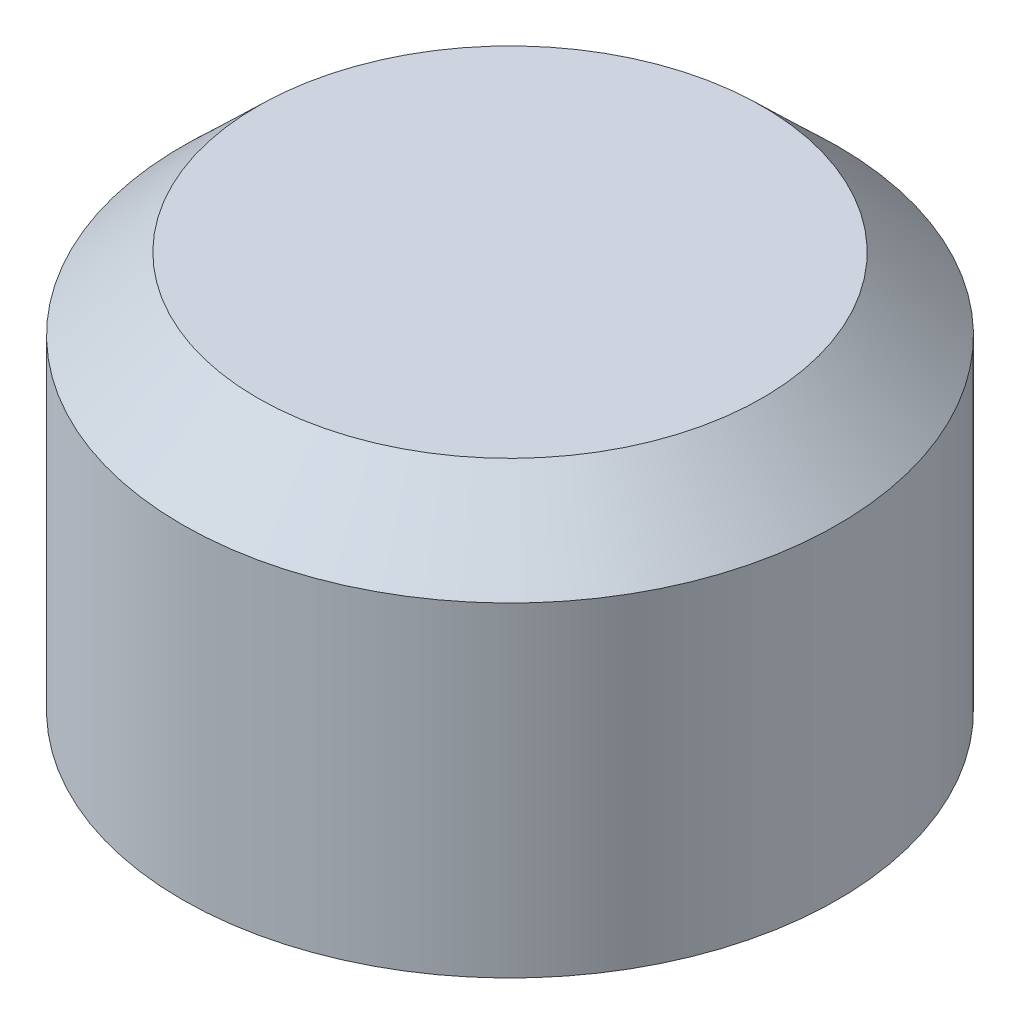
ISO-10303-21;
HEADER;
FILE_DESCRIPTION(('STEP AP214'),'2;1');
FILE_NAME('part.step','',(''),(''),'','','');
FILE_SCHEMA(('AUTOMOTIVE_DESIGN { 1 0 10303 214 1 1 1 1 }'));
ENDSEC;
DATA;
#1=APPLICATION_CONTEXT('core data for automotive mechanical design processes');
#2=APPLICATION_PROTOCOL_DEFINITION('international standard','automotive_design',2000,#1);
#3=PRODUCT_CONTEXT('',#1,'mechanical');
#4=PRODUCT('Part','Part','',(#3));
#5=PRODUCT_RELATED_PRODUCT_CATEGORY('part','',(#4));
#6=PRODUCT_DEFINITION_FORMATION('','',#4);
#7=PRODUCT_DEFINITION_CONTEXT('part definition',#1,'design');
#8=PRODUCT_DEFINITION('design','',#6,#7);
#9=PRODUCT_DEFINITION_SHAPE('','',#8);
#10=(LENGTH_UNIT() NAMED_UNIT(*) SI_UNIT(.MILLI.,.METRE.));
#11=(NAMED_UNIT(*) PLANE_ANGLE_UNIT() SI_UNIT($,.RADIAN.));
#12=(NAMED_UNIT(*) SI_UNIT($,.STERADIAN.) SOLID_ANGLE_UNIT());
#13=UNCERTAINTY_MEASURE_WITH_UNIT(LENGTH_MEASURE(1.E-05),#10,'distance_accuracy_value','');
#14=(GEOMETRIC_REPRESENTATION_CONTEXT(3) GLOBAL_UNCERTAINTY_ASSIGNED_CONTEXT((#13)) GLOBAL_UNIT_ASSIGNED_CONTEXT((#10,
#11,#12)) REPRESENTATION_CONTEXT('',''));
#15=CARTESIAN_POINT('',(0.,0.,0.));
#16=DIRECTION('',(0.,0.,1.));
#17=DIRECTION('',(1.,0.,0.));
#18=AXIS2_PLACEMENT_3D('',#15,#16,#17);
#19=CARTESIAN_POINT('',(0.,3520.44,0.));
#20=DIRECTION('',(0.,1.,0.));
#21=DIRECTION('',(0.,0.,1.));
#22=AXIS2_PLACEMENT_3D('',#19,#20,#21);
#23=CYLINDRICAL_SURFACE('',#22,2743.2);
#24=CARTESIAN_POINT('',(0.,2732.37406594724,0.));
#25=DIRECTION('',(0.,1.,0.));
#26=DIRECTION('',(0.,0.,1.));
#27=AXIS2_PLACEMENT_3D('',#24,#25,#26);
#28=CIRCLE('',#27,2743.2);
#29=CARTESIAN_POINT('',(0.,2732.37406594724,2743.2));
#30=VERTEX_POINT('',#29);
#31=EDGE_CURVE('E74',#30,#30,#28,.T.);
#32=ORIENTED_EDGE('',*,*,#31,.T.);
#33=EDGE_LOOP('',(#32));
#34=FACE_BOUND('',#33,.T.);
#35=CARTESIAN_POINT('',(0.,0.,0.));
#36=DIRECTION('',(0.,1.,0.));
#37=DIRECTION('',(0.,0.,1.));
#38=AXIS2_PLACEMENT_3D('',#35,#36,#37);
#39=CIRCLE('',#38,2743.2);
#40=CARTESIAN_POINT('',(0.,0.,2743.2));
#41=VERTEX_POINT('',#40);
#42=EDGE_CURVE('E11',#41,#41,#39,.T.);
#43=ORIENTED_EDGE('',*,*,#42,.F.);
#44=EDGE_LOOP('',(#43));
#45=FACE_BOUND('',#44,.T.);
#46=ADVANCED_FACE('F47',(#34,#45),#23,.F.);
#47=CARTESIAN_POINT('',(-2743.2,0.,0.));
#48=DIRECTION('',(0.,-1.,0.));
#49=DIRECTION('',(0.,0.,-1.));
#50=AXIS2_PLACEMENT_3D('',#47,#48,#49);
#51=PLANE('',#50);
#52=ORIENTED_EDGE('',*,*,#42,.T.);
#53=EDGE_LOOP('',(#52));
#54=FACE_BOUND('',#53,.T.);
#55=CARTESIAN_POINT('',(0.,0.,0.));
#56=DIRECTION('',(0.,1.,0.));
#57=DIRECTION('',(0.,0.,1.));
#58=AXIS2_PLACEMENT_3D('',#55,#56,#57);
#59=CIRCLE('',#58,2768.6);
#60=CARTESIAN_POINT('',(0.,0.,2768.6));
#61=VERTEX_POINT('',#60);
#62=EDGE_CURVE('E54',#61,#61,#59,.T.);
#63=ORIENTED_EDGE('',*,*,#62,.F.);
#64=EDGE_LOOP('',(#63));
#65=FACE_BOUND('',#64,.T.);
#66=ADVANCED_FACE('F93',(#54,#65),#51,.T.);
#67=CARTESIAN_POINT('',(0.,3520.44,0.));
#68=DIRECTION('',(0.,1.,0.));
#69=DIRECTION('',(0.,0.,1.));
#70=AXIS2_PLACEMENT_3D('',#67,#68,#69);
#71=CYLINDRICAL_SURFACE('',#70,2768.6);
#72=ORIENTED_EDGE('',*,*,#62,.T.);
#73=EDGE_LOOP('',(#72));
#74=FACE_BOUND('',#73,.T.);
#75=CARTESIAN_POINT('',(0.,2743.2,0.));
#76=DIRECTION('',(0.,1.,0.));
#77=DIRECTION('',(0.,0.,1.));
#78=AXIS2_PLACEMENT_3D('',#75,#76,#77);
#79=CIRCLE('',#78,2768.6);
#80=CARTESIAN_POINT('',(0.,2743.2,2768.6));
#81=VERTEX_POINT('',#80);
#82=EDGE_CURVE('E59',#81,#81,#79,.T.);
#83=ORIENTED_EDGE('',*,*,#82,.F.);
#84=EDGE_LOOP('',(#83));
#85=FACE_BOUND('',#84,.T.);
#86=ADVANCED_FACE('F97',(#74,#85),#71,.T.);
#87=CARTESIAN_POINT('',(0.,3352.8,0.));
#88=DIRECTION('',(0.,-1.,0.));
#89=DIRECTION('',(0.,0.,-1.));
#90=AXIS2_PLACEMENT_3D('',#87,#88,#89);
#91=CONICAL_SURFACE('',#90,2133.6,0.805803494083987);
#92=ORIENTED_EDGE('',*,*,#82,.T.);
#93=EDGE_LOOP('',(#92));
#94=FACE_BOUND('',#93,.T.);
#95=CARTESIAN_POINT('',(0.,3352.8,0.));
#96=DIRECTION('',(0.,1.,0.));
#97=DIRECTION('',(0.,0.,1.));
#98=AXIS2_PLACEMENT_3D('',#95,#96,#97);
#99=CIRCLE('',#98,2133.6);
#100=CARTESIAN_POINT('',(0.,3352.8,2133.6));
#101=VERTEX_POINT('',#100);
#102=EDGE_CURVE('E64',#101,#101,#99,.T.);
#103=ORIENTED_EDGE('',*,*,#102,.F.);
#104=EDGE_LOOP('',(#103));
#105=FACE_BOUND('',#104,.T.);
#106=ADVANCED_FACE('F101',(#94,#105),#91,.T.);
#107=CARTESIAN_POINT('',(0.,3352.8,0.));
#108=DIRECTION('',(0.,1.,0.));
#109=DIRECTION('',(0.,0.,1.));
#110=AXIS2_PLACEMENT_3D('',#107,#108,#109);
#111=PLANE('',#110);
#112=ORIENTED_EDGE('',*,*,#102,.T.);
#113=EDGE_LOOP('',(#112));
#114=FACE_BOUND('',#113,.T.);
#115=ADVANCED_FACE('F89',(#114),#111,.T.);
#116=CARTESIAN_POINT('',(-2123.38131869504,3327.4,0.));
#117=DIRECTION('',(0.,-1.,0.));
#118=DIRECTION('',(0.,0.,-1.));
#119=AXIS2_PLACEMENT_3D('',#116,#117,#118);
#120=PLANE('',#119);
#121=CARTESIAN_POINT('',(0.,3327.4,0.));
#122=DIRECTION('',(0.,1.,0.));
#123=DIRECTION('',(0.,0.,1.));
#124=AXIS2_PLACEMENT_3D('',#121,#122,#123);
#125=CIRCLE('',#124,2123.38131869504);
#126=CARTESIAN_POINT('',(0.,3327.4,2123.38131869504));
#127=VERTEX_POINT('',#126);
#128=EDGE_CURVE('E70',#127,#127,#125,.T.);
#129=ORIENTED_EDGE('',*,*,#128,.F.);
#130=EDGE_LOOP('',(#129));
#131=FACE_BOUND('',#130,.T.);
#132=ADVANCED_FACE('F83',(#131),#120,.T.);
#133=CARTESIAN_POINT('',(0.,2732.37406594724,0.));
#134=DIRECTION('',(0.,-1.,0.));
#135=DIRECTION('',(0.,0.,-1.));
#136=AXIS2_PLACEMENT_3D('',#133,#134,#135);
#137=CONICAL_SURFACE('',#136,2743.2,0.805803494083986);
#138=ORIENTED_EDGE('',*,*,#128,.T.);
#139=EDGE_LOOP('',(#138));
#140=FACE_BOUND('',#139,.T.);
#141=ORIENTED_EDGE('',*,*,#31,.F.);
#142=EDGE_LOOP('',(#141));
#143=FACE_BOUND('',#142,.T.);
#144=ADVANCED_FACE('F81',(#140,#143),#137,.F.);
#145=CLOSED_SHELL('',(#46,#66,#86,#106,#115,#132,#144));
#146=MANIFOLD_SOLID_BREP('B2',#145);
#147=CARTESIAN_POINT('',(-2413.,0.,0.));
#148=DIRECTION('',(0.,-1.,0.));
#149=DIRECTION('',(0.,0.,-1.));
#150=AXIS2_PLACEMENT_3D('',#147,#148,#149);
#151=PLANE('',#150);
#152=CARTESIAN_POINT('',(0.,0.,0.));
#153=DIRECTION('',(0.,1.,0.));
#154=DIRECTION('',(0.,0.,1.));
#155=AXIS2_PLACEMENT_3D('',#152,#153,#154);
#156=CIRCLE('',#155,2413.);
#157=CARTESIAN_POINT('',(0.,0.,2413.));
#158=VERTEX_POINT('',#157);
#159=EDGE_CURVE('E207',#158,#158,#156,.T.);
#160=ORIENTED_EDGE('',*,*,#159,.T.);
#161=EDGE_LOOP('',(#160));
#162=FACE_BOUND('',#161,.T.);
#163=CARTESIAN_POINT('',(0.,0.,0.));
#164=DIRECTION('',(0.,1.,0.));
#165=DIRECTION('',(0.,0.,1.));
#166=AXIS2_PLACEMENT_3D('',#163,#164,#165);
#167=CIRCLE('',#166,2438.4);
#168=CARTESIAN_POINT('',(0.,0.,2438.4));
#169=VERTEX_POINT('',#168);
#170=EDGE_CURVE('E46',#169,#169,#167,.T.);
#171=ORIENTED_EDGE('',*,*,#170,.F.);
#172=EDGE_LOOP('',(#171));
#173=FACE_BOUND('',#172,.T.);
#174=ADVANCED_FACE('F161',(#162,#173),#151,.T.);
#175=CARTESIAN_POINT('',(0.,3520.44,0.));
#176=DIRECTION('',(0.,1.,0.));
#177=DIRECTION('',(0.,0.,1.));
#178=AXIS2_PLACEMENT_3D('',#175,#176,#177);
#179=CYLINDRICAL_SURFACE('',#178,2438.4);
#180=ORIENTED_EDGE('',*,*,#170,.T.);
#181=EDGE_LOOP('',(#180));
#182=FACE_BOUND('',#181,.T.);
#183=CARTESIAN_POINT('',(0.,2753.72102448428,0.));
#184=DIRECTION('',(0.,1.,0.));
#185=DIRECTION('',(0.,0.,1.));
#186=AXIS2_PLACEMENT_3D('',#183,#184,#185);
#187=CIRCLE('',#186,2438.4);
#188=CARTESIAN_POINT('',(0.,2753.72102448428,2438.4));
#189=VERTEX_POINT('',#188);
#190=EDGE_CURVE('E167',#189,#189,#187,.T.);
#191=ORIENTED_EDGE('',*,*,#190,.F.);
#192=EDGE_LOOP('',(#191));
#193=FACE_BOUND('',#192,.T.);
#194=ADVANCED_FACE('F225',(#182,#193),#179,.T.);
#195=CARTESIAN_POINT('',(0.,3073.4,0.));
#196=DIRECTION('',(0.,-1.,0.));
#197=DIRECTION('',(0.,0.,-1.));
#198=AXIS2_PLACEMENT_3D('',#195,#196,#197);
#199=CONICAL_SURFACE('',#198,2118.72102448428,0.785398163397448);
#200=ORIENTED_EDGE('',*,*,#190,.T.);
#201=EDGE_LOOP('',(#200));
#202=FACE_BOUND('',#201,.T.);
#203=CARTESIAN_POINT('',(0.,3073.4,0.));
#204=DIRECTION('',(0.,1.,0.));
#205=DIRECTION('',(0.,0.,1.));
#206=AXIS2_PLACEMENT_3D('',#203,#204,#205);
#207=CIRCLE('',#206,2118.72102448428);
#208=CARTESIAN_POINT('',(0.,3073.4,2118.72102448428));
#209=VERTEX_POINT('',#208);
#210=EDGE_CURVE('E171',#209,#209,#207,.T.);
#211=ORIENTED_EDGE('',*,*,#210,.F.);
#212=EDGE_LOOP('',(#211));
#213=FACE_BOUND('',#212,.T.);
#214=ADVANCED_FACE('F229',(#202,#213),#199,.T.);
#215=CARTESIAN_POINT('',(-2118.72102448428,3073.4,0.));
#216=DIRECTION('',(0.,1.,0.));
#217=DIRECTION('',(0.,0.,1.));
#218=AXIS2_PLACEMENT_3D('',#215,#216,#217);
#219=PLANE('',#218);
#220=ORIENTED_EDGE('',*,*,#210,.T.);
#221=EDGE_LOOP('',(#220));
#222=FACE_BOUND('',#221,.T.);
#223=CARTESIAN_POINT('',(0.,3073.4,0.));
#224=DIRECTION('',(0.,1.,0.));
#225=DIRECTION('',(0.,0.,1.));
#226=AXIS2_PLACEMENT_3D('',#223,#224,#225);
#227=CIRCLE('',#226,1190.87720649982);
#228=CARTESIAN_POINT('',(0.,3073.4,1190.87720649982));
#229=VERTEX_POINT('',#228);
#230=EDGE_CURVE('E175',#229,#229,#227,.T.);
#231=ORIENTED_EDGE('',*,*,#230,.F.);
#232=EDGE_LOOP('',(#231));
#233=FACE_BOUND('',#232,.T.);
#234=ADVANCED_FACE('F233',(#222,#233),#219,.T.);
#235=CARTESIAN_POINT('',(0.,2796.92279350018,0.));
#236=DIRECTION('',(0.,1.,0.));
#237=DIRECTION('',(0.,0.,1.));
#238=AXIS2_PLACEMENT_3D('',#235,#236,#237);
#239=CONICAL_SURFACE('',#238,914.400000000001,0.785398163397449);
#240=ORIENTED_EDGE('',*,*,#230,.T.);
#241=EDGE_LOOP('',(#240));
#242=FACE_BOUND('',#241,.T.);
#243=CARTESIAN_POINT('',(0.,2796.92279350018,0.));
#244=DIRECTION('',(0.,1.,0.));
#245=DIRECTION('',(0.,0.,1.));
#246=AXIS2_PLACEMENT_3D('',#243,#244,#245);
#247=CIRCLE('',#246,914.400000000001);
#248=CARTESIAN_POINT('',(0.,2796.92279350018,914.400000000001));
#249=VERTEX_POINT('',#248);
#250=EDGE_CURVE('E180',#249,#249,#247,.T.);
#251=ORIENTED_EDGE('',*,*,#250,.F.);
#252=EDGE_LOOP('',(#251));
#253=FACE_BOUND('',#252,.T.);
#254=ADVANCED_FACE('F239',(#242,#253),#239,.F.);
#255=CARTESIAN_POINT('',(0.,3520.44,0.));
#256=DIRECTION('',(0.,1.,0.));
#257=DIRECTION('',(0.,0.,1.));
#258=AXIS2_PLACEMENT_3D('',#255,#256,#257);
#259=CYLINDRICAL_SURFACE('',#258,914.400000000001);
#260=ORIENTED_EDGE('',*,*,#250,.T.);
#261=EDGE_LOOP('',(#260));
#262=FACE_BOUND('',#261,.T.);
#263=CARTESIAN_POINT('',(0.,2074.,0.));
#264=DIRECTION('',(0.,1.,0.));
#265=DIRECTION('',(0.,0.,1.));
#266=AXIS2_PLACEMENT_3D('',#263,#264,#265);
#267=CIRCLE('',#266,914.4);
#268=CARTESIAN_POINT('',(0.,2074.,914.4));
#269=VERTEX_POINT('',#268);
#270=EDGE_CURVE('E183',#269,#269,#267,.T.);
#271=ORIENTED_EDGE('',*,*,#270,.F.);
#272=EDGE_LOOP('',(#271));
#273=FACE_BOUND('',#272,.T.);
#274=ADVANCED_FACE('F243',(#262,#273),#259,.F.);
#275=CARTESIAN_POINT('',(0.,1524.30107327311,0.));
#276=DIRECTION('',(0.,1.,0.));
#277=DIRECTION('',(0.,0.,1.));
#278=AXIS2_PLACEMENT_3D('',#275,#276,#277);
#279=CONICAL_SURFACE('',#278,597.03117668098,0.523598775598301);
#280=ORIENTED_EDGE('',*,*,#270,.T.);
#281=EDGE_LOOP('',(#280));
#282=FACE_BOUND('',#281,.T.);
#283=CARTESIAN_POINT('',(0.,1524.30107327311,0.));
#284=DIRECTION('',(0.,1.,0.));
#285=DIRECTION('',(0.,0.,1.));
#286=AXIS2_PLACEMENT_3D('',#283,#284,#285);
#287=CIRCLE('',#286,597.03117668098);
#288=CARTESIAN_POINT('',(0.,1524.30107327311,597.03117668098));
#289=VERTEX_POINT('',#288);
#290=EDGE_CURVE('E186',#289,#289,#287,.T.);
#291=ORIENTED_EDGE('',*,*,#290,.F.);
#292=EDGE_LOOP('',(#291));
#293=FACE_BOUND('',#292,.T.);
#294=ADVANCED_FACE('F247',(#282,#293),#279,.F.);
#295=CARTESIAN_POINT('',(-597.03117668098,1524.30107327311,0.));
#296=DIRECTION('',(0.,-1.,0.));
#297=DIRECTION('',(0.,0.,-1.));
#298=AXIS2_PLACEMENT_3D('',#295,#296,#297);
#299=PLANE('',#298);
#300=ORIENTED_EDGE('',*,*,#290,.T.);
#301=EDGE_LOOP('',(#300));
#302=FACE_BOUND('',#301,.T.);
#303=CARTESIAN_POINT('',(0.,1524.30107327311,0.));
#304=DIRECTION('',(0.,1.,0.));
#305=DIRECTION('',(0.,0.,1.));
#306=AXIS2_PLACEMENT_3D('',#303,#304,#305);
#307=CIRCLE('',#306,622.43117668098);
#308=CARTESIAN_POINT('',(0.,1524.30107327311,622.43117668098));
#309=VERTEX_POINT('',#308);
#310=EDGE_CURVE('E189',#309,#309,#307,.T.);
#311=ORIENTED_EDGE('',*,*,#310,.F.);
#312=EDGE_LOOP('',(#311));
#313=FACE_BOUND('',#312,.T.);
#314=ADVANCED_FACE('F251',(#302,#313),#299,.T.);
#315=CARTESIAN_POINT('',(0.,2074.,0.));
#316=DIRECTION('',(0.,1.,0.));
#317=DIRECTION('',(0.,0.,1.));
#318=AXIS2_PLACEMENT_3D('',#315,#316,#317);
#319=CONICAL_SURFACE('',#318,939.800000000001,0.523598775598303);
#320=ORIENTED_EDGE('',*,*,#310,.T.);
#321=EDGE_LOOP('',(#320));
#322=FACE_BOUND('',#321,.T.);
#323=CARTESIAN_POINT('',(0.,2074.,0.));
#324=DIRECTION('',(0.,1.,0.));
#325=DIRECTION('',(0.,0.,1.));
#326=AXIS2_PLACEMENT_3D('',#323,#324,#325);
#327=CIRCLE('',#326,939.800000000001);
#328=CARTESIAN_POINT('',(0.,2074.,939.800000000001));
#329=VERTEX_POINT('',#328);
#330=EDGE_CURVE('E192',#329,#329,#327,.T.);
#331=ORIENTED_EDGE('',*,*,#330,.F.);
#332=EDGE_LOOP('',(#331));
#333=FACE_BOUND('',#332,.T.);
#334=ADVANCED_FACE('F255',(#322,#333),#319,.T.);
#335=CARTESIAN_POINT('',(0.,3520.44,0.));
#336=DIRECTION('',(0.,1.,0.));
#337=DIRECTION('',(0.,0.,1.));
#338=AXIS2_PLACEMENT_3D('',#335,#336,#337);
#339=CYLINDRICAL_SURFACE('',#338,939.800000000001);
#340=ORIENTED_EDGE('',*,*,#330,.T.);
#341=EDGE_LOOP('',(#340));
#342=FACE_BOUND('',#341,.T.);
#343=CARTESIAN_POINT('',(0.,2786.4017690159,0.));
#344=DIRECTION('',(0.,1.,0.));
#345=DIRECTION('',(0.,0.,1.));
#346=AXIS2_PLACEMENT_3D('',#343,#344,#345);
#347=CIRCLE('',#346,939.8);
#348=CARTESIAN_POINT('',(0.,2786.4017690159,939.8));
#349=VERTEX_POINT('',#348);
#350=EDGE_CURVE('E195',#349,#349,#347,.T.);
#351=ORIENTED_EDGE('',*,*,#350,.F.);
#352=EDGE_LOOP('',(#351));
#353=FACE_BOUND('',#352,.T.);
#354=ADVANCED_FACE('F259',(#342,#353),#339,.T.);
#355=CARTESIAN_POINT('',(0.,3048.,0.));
#356=DIRECTION('',(0.,1.,0.));
#357=DIRECTION('',(0.,0.,1.));
#358=AXIS2_PLACEMENT_3D('',#355,#356,#357);
#359=CONICAL_SURFACE('',#358,1201.3982309841,0.785398163397449);
#360=ORIENTED_EDGE('',*,*,#350,.T.);
#361=EDGE_LOOP('',(#360));
#362=FACE_BOUND('',#361,.T.);
#363=CARTESIAN_POINT('',(0.,3048.,0.));
#364=DIRECTION('',(0.,1.,0.));
#365=DIRECTION('',(0.,0.,1.));
#366=AXIS2_PLACEMENT_3D('',#363,#364,#365);
#367=CIRCLE('',#366,1201.3982309841);
#368=CARTESIAN_POINT('',(0.,3048.,1201.3982309841));
#369=VERTEX_POINT('',#368);
#370=EDGE_CURVE('E198',#369,#369,#367,.T.);
#371=ORIENTED_EDGE('',*,*,#370,.F.);
#372=EDGE_LOOP('',(#371));
#373=FACE_BOUND('',#372,.T.);
#374=ADVANCED_FACE('F263',(#362,#373),#359,.T.);
#375=CARTESIAN_POINT('',(-1201.3982309841,3048.,0.));
#376=DIRECTION('',(0.,-1.,0.));
#377=DIRECTION('',(0.,0.,-1.));
#378=AXIS2_PLACEMENT_3D('',#375,#376,#377);
#379=PLANE('',#378);
#380=ORIENTED_EDGE('',*,*,#370,.T.);
#381=EDGE_LOOP('',(#380));
#382=FACE_BOUND('',#381,.T.);
#383=CARTESIAN_POINT('',(0.,3048.,0.));
#384=DIRECTION('',(0.,1.,0.));
#385=DIRECTION('',(0.,0.,1.));
#386=AXIS2_PLACEMENT_3D('',#383,#384,#385);
#387=CIRCLE('',#386,2108.2);
#388=CARTESIAN_POINT('',(0.,3048.,2108.2));
#389=VERTEX_POINT('',#388);
#390=EDGE_CURVE('E201',#389,#389,#387,.T.);
#391=ORIENTED_EDGE('',*,*,#390,.F.);
#392=EDGE_LOOP('',(#391));
#393=FACE_BOUND('',#392,.T.);
#394=ADVANCED_FACE('F221',(#382,#393),#379,.T.);
#395=CARTESIAN_POINT('',(0.,2743.2,0.));
#396=DIRECTION('',(0.,-1.,0.));
#397=DIRECTION('',(0.,0.,-1.));
#398=AXIS2_PLACEMENT_3D('',#395,#396,#397);
#399=CONICAL_SURFACE('',#398,2413.,0.785398163397448);
#400=ORIENTED_EDGE('',*,*,#390,.T.);
#401=EDGE_LOOP('',(#400));
#402=FACE_BOUND('',#401,.T.);
#403=CARTESIAN_POINT('',(0.,2743.2,0.));
#404=DIRECTION('',(0.,1.,0.));
#405=DIRECTION('',(0.,0.,1.));
#406=AXIS2_PLACEMENT_3D('',#403,#404,#405);
#407=CIRCLE('',#406,2413.);
#408=CARTESIAN_POINT('',(0.,2743.2,2413.));
#409=VERTEX_POINT('',#408);
#410=EDGE_CURVE('E204',#409,#409,#407,.T.);
#411=ORIENTED_EDGE('',*,*,#410,.F.);
#412=EDGE_LOOP('',(#411));
#413=FACE_BOUND('',#412,.T.);
#414=ADVANCED_FACE('F215',(#402,#413),#399,.F.);
#415=CARTESIAN_POINT('',(0.,3520.44,0.));
#416=DIRECTION('',(0.,1.,0.));
#417=DIRECTION('',(0.,0.,1.));
#418=AXIS2_PLACEMENT_3D('',#415,#416,#417);
#419=CYLINDRICAL_SURFACE('',#418,2413.);
#420=ORIENTED_EDGE('',*,*,#410,.T.);
#421=EDGE_LOOP('',(#420));
#422=FACE_BOUND('',#421,.T.);
#423=ORIENTED_EDGE('',*,*,#159,.F.);
#424=EDGE_LOOP('',(#423));
#425=FACE_BOUND('',#424,.T.);
#426=ADVANCED_FACE('F213',(#422,#425),#419,.F.);
#427=CLOSED_SHELL('',(#174,#194,#214,#234,#254,#274,#294,#314,#334,#354,#374,#394,#414,#426));
#428=MANIFOLD_SOLID_BREP('B6',#427);
#429=ADVANCED_BREP_SHAPE_REPRESENTATION('',(#18,#146,#428),#14);
#430=SHAPE_DEFINITION_REPRESENTATION(#9,#429);
ENDSEC;
END-ISO-10303-21;
